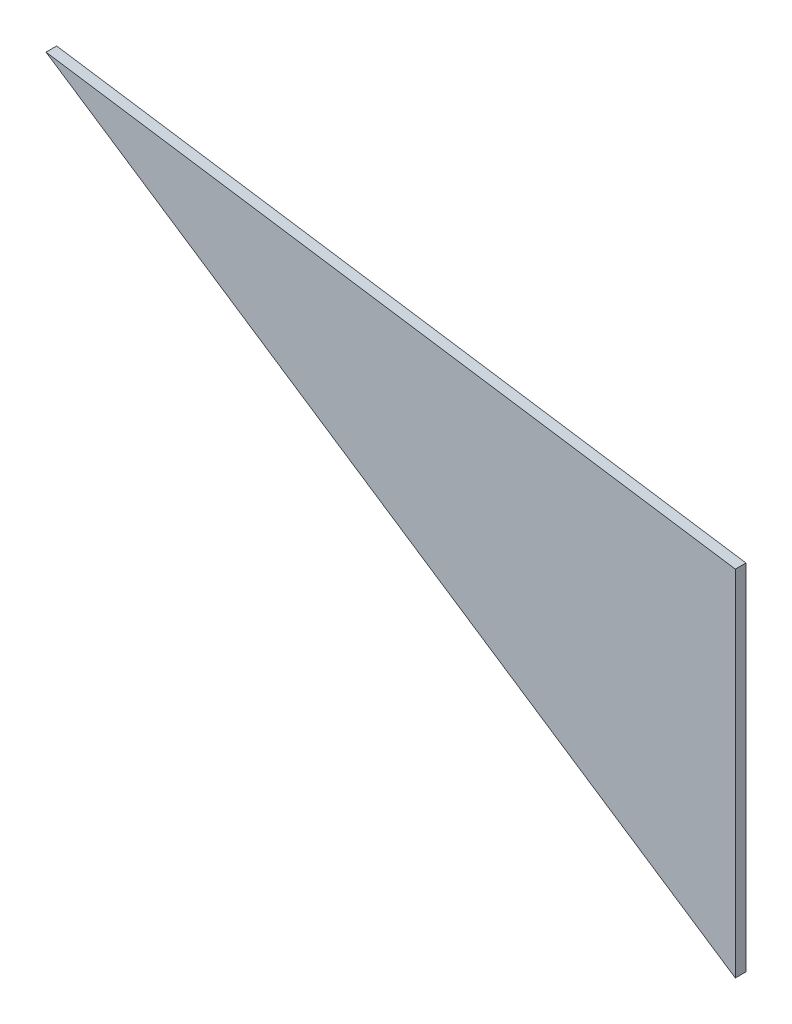
ISO-10303-21;
HEADER;
FILE_DESCRIPTION(('STEP AP214'),'2;1');
FILE_NAME('part.step','',(''),(''),'','','');
FILE_SCHEMA(('AUTOMOTIVE_DESIGN { 1 0 10303 214 1 1 1 1 }'));
ENDSEC;
DATA;
#1=APPLICATION_CONTEXT('core data for automotive mechanical design processes');
#2=APPLICATION_PROTOCOL_DEFINITION('international standard','automotive_design',2000,#1);
#3=PRODUCT_CONTEXT('',#1,'mechanical');
#4=PRODUCT('Part','Part','',(#3));
#5=PRODUCT_RELATED_PRODUCT_CATEGORY('part','',(#4));
#6=PRODUCT_DEFINITION_FORMATION('','',#4);
#7=PRODUCT_DEFINITION_CONTEXT('part definition',#1,'design');
#8=PRODUCT_DEFINITION('design','',#6,#7);
#9=PRODUCT_DEFINITION_SHAPE('','',#8);
#10=(LENGTH_UNIT() NAMED_UNIT(*) SI_UNIT(.MILLI.,.METRE.));
#11=(NAMED_UNIT(*) PLANE_ANGLE_UNIT() SI_UNIT($,.RADIAN.));
#12=(NAMED_UNIT(*) SI_UNIT($,.STERADIAN.) SOLID_ANGLE_UNIT());
#13=UNCERTAINTY_MEASURE_WITH_UNIT(LENGTH_MEASURE(1.E-05),#10,'distance_accuracy_value','');
#14=(GEOMETRIC_REPRESENTATION_CONTEXT(3) GLOBAL_UNCERTAINTY_ASSIGNED_CONTEXT((#13)) GLOBAL_UNIT_ASSIGNED_CONTEXT((#10,
#11,#12)) REPRESENTATION_CONTEXT('',''));
#15=CARTESIAN_POINT('',(0.,0.,0.));
#16=DIRECTION('',(0.,0.,1.));
#17=DIRECTION('',(1.,0.,0.));
#18=AXIS2_PLACEMENT_3D('',#15,#16,#17);
#19=CARTESIAN_POINT('',(-210.680056234935,173.373216465761,10.));
#20=DIRECTION('',(-0.147851118919844,-0.989009629191825,0.));
#21=DIRECTION('',(0.989009629191825,-0.147851118919844,0.));
#22=AXIS2_PLACEMENT_3D('',#19,#20,#21);
#23=PLANE('',#22);
#24=DIRECTION('',(-0.989009629191824,0.147851118919844,0.));
#25=VECTOR('',#24,1.);
#26=CARTESIAN_POINT('',(-210.680056234935,173.373216465761,0.));
#27=LINE('',#26,#25);
#28=CARTESIAN_POINT('',(-210.680056234935,173.373216465761,0.));
#29=VERTEX_POINT('',#28);
#30=CARTESIAN_POINT('',(-859.317008091907,270.340623328298,0.));
#31=VERTEX_POINT('',#30);
#32=EDGE_CURVE('E82',#29,#31,#27,.T.);
#33=ORIENTED_EDGE('',*,*,#32,.T.);
#34=DIRECTION('',(0.,0.,-1.));
#35=VECTOR('',#34,1.);
#36=CARTESIAN_POINT('',(-859.317008091907,270.340623328298,10.));
#37=LINE('',#36,#35);
#38=CARTESIAN_POINT('',(-859.317008091907,270.340623328298,10.));
#39=VERTEX_POINT('',#38);
#40=EDGE_CURVE('E11',#39,#31,#37,.T.);
#41=ORIENTED_EDGE('',*,*,#40,.F.);
#42=DIRECTION('',(-0.989009629191824,0.147851118919844,0.));
#43=VECTOR('',#42,1.);
#44=CARTESIAN_POINT('',(-210.680056234935,173.373216465761,10.));
#45=LINE('',#44,#43);
#46=CARTESIAN_POINT('',(-210.680056234935,173.373216465761,10.));
#47=VERTEX_POINT('',#46);
#48=EDGE_CURVE('E75',#47,#39,#45,.T.);
#49=ORIENTED_EDGE('',*,*,#48,.F.);
#50=DIRECTION('',(0.,0.,-1.));
#51=VECTOR('',#50,1.);
#52=CARTESIAN_POINT('',(-210.680056234935,173.373216465761,10.));
#53=LINE('',#52,#51);
#54=EDGE_CURVE('E83',#47,#29,#53,.T.);
#55=ORIENTED_EDGE('',*,*,#54,.T.);
#56=EDGE_LOOP('',(#33,#41,#49,#55));
#57=FACE_BOUND('',#56,.T.);
#58=ADVANCED_FACE('F35',(#57),#23,.F.);
#59=CARTESIAN_POINT('',(-210.680056234935,-159.825581884861,10.));
#60=DIRECTION('',(0.552689714472756,0.833387112640952,0.));
#61=DIRECTION('',(-0.833387112640952,0.552689714472756,0.));
#62=AXIS2_PLACEMENT_3D('',#59,#60,#61);
#63=PLANE('',#62);
#64=DIRECTION('',(0.833387112640952,-0.552689714472756,0.));
#65=VECTOR('',#64,1.);
#66=CARTESIAN_POINT('',(-210.680056234935,-159.825581884861,0.));
#67=LINE('',#66,#65);
#68=CARTESIAN_POINT('',(-210.680056234935,-159.825581884861,0.));
#69=VERTEX_POINT('',#68);
#70=EDGE_CURVE('E63',#31,#69,#67,.T.);
#71=ORIENTED_EDGE('',*,*,#70,.T.);
#72=DIRECTION('',(0.,0.,-1.));
#73=VECTOR('',#72,1.);
#74=CARTESIAN_POINT('',(-210.680056234935,-159.825581884861,10.));
#75=LINE('',#74,#73);
#76=CARTESIAN_POINT('',(-210.680056234935,-159.825581884861,10.));
#77=VERTEX_POINT('',#76);
#78=EDGE_CURVE('E43',#77,#69,#75,.T.);
#79=ORIENTED_EDGE('',*,*,#78,.F.);
#80=DIRECTION('',(0.833387112640952,-0.552689714472756,0.));
#81=VECTOR('',#80,1.);
#82=CARTESIAN_POINT('',(-210.680056234935,-159.825581884861,10.));
#83=LINE('',#82,#81);
#84=EDGE_CURVE('E71',#39,#77,#83,.T.);
#85=ORIENTED_EDGE('',*,*,#84,.F.);
#86=ORIENTED_EDGE('',*,*,#40,.T.);
#87=EDGE_LOOP('',(#71,#79,#85,#86));
#88=FACE_BOUND('',#87,.T.);
#89=ADVANCED_FACE('F72',(#88),#63,.F.);
#90=CARTESIAN_POINT('',(-210.680056234935,173.373216465761,10.));
#91=DIRECTION('',(-1.,0.,0.));
#92=DIRECTION('',(0.,0.,1.));
#93=AXIS2_PLACEMENT_3D('',#90,#91,#92);
#94=PLANE('',#93);
#95=DIRECTION('',(0.,1.,0.));
#96=VECTOR('',#95,1.);
#97=CARTESIAN_POINT('',(-210.680056234935,173.373216465761,0.));
#98=LINE('',#97,#96);
#99=EDGE_CURVE('E68',#69,#29,#98,.T.);
#100=ORIENTED_EDGE('',*,*,#99,.T.);
#101=ORIENTED_EDGE('',*,*,#54,.F.);
#102=DIRECTION('',(0.,1.,0.));
#103=VECTOR('',#102,1.);
#104=CARTESIAN_POINT('',(-210.680056234935,173.373216465761,10.));
#105=LINE('',#104,#103);
#106=EDGE_CURVE('E51',#77,#47,#105,.T.);
#107=ORIENTED_EDGE('',*,*,#106,.F.);
#108=ORIENTED_EDGE('',*,*,#78,.T.);
#109=EDGE_LOOP('',(#100,#101,#107,#108));
#110=FACE_BOUND('',#109,.T.);
#111=ADVANCED_FACE('F90',(#110),#94,.F.);
#112=CARTESIAN_POINT('',(0.,0.,10.));
#113=DIRECTION('',(0.,0.,1.));
#114=DIRECTION('',(1.,0.,0.));
#115=AXIS2_PLACEMENT_3D('',#112,#113,#114);
#116=PLANE('',#115);
#117=ORIENTED_EDGE('',*,*,#48,.T.);
#118=ORIENTED_EDGE('',*,*,#84,.T.);
#119=ORIENTED_EDGE('',*,*,#106,.T.);
#120=EDGE_LOOP('',(#117,#118,#119));
#121=FACE_BOUND('',#120,.T.);
#122=ADVANCED_FACE('F78',(#121),#116,.T.);
#123=CARTESIAN_POINT('',(0.,0.,0.));
#124=DIRECTION('',(0.,0.,1.));
#125=DIRECTION('',(1.,0.,0.));
#126=AXIS2_PLACEMENT_3D('',#123,#124,#125);
#127=PLANE('',#126);
#128=ORIENTED_EDGE('',*,*,#32,.F.);
#129=ORIENTED_EDGE('',*,*,#99,.F.);
#130=ORIENTED_EDGE('',*,*,#70,.F.);
#131=EDGE_LOOP('',(#128,#129,#130));
#132=FACE_BOUND('',#131,.T.);
#133=ADVANCED_FACE('F91',(#132),#127,.F.);
#134=CLOSED_SHELL('',(#58,#89,#111,#122,#133));
#135=MANIFOLD_SOLID_BREP('B2',#134);
#136=ADVANCED_BREP_SHAPE_REPRESENTATION('',(#18,#135),#14);
#137=SHAPE_DEFINITION_REPRESENTATION(#9,#136);
ENDSEC;
END-ISO-10303-21;
